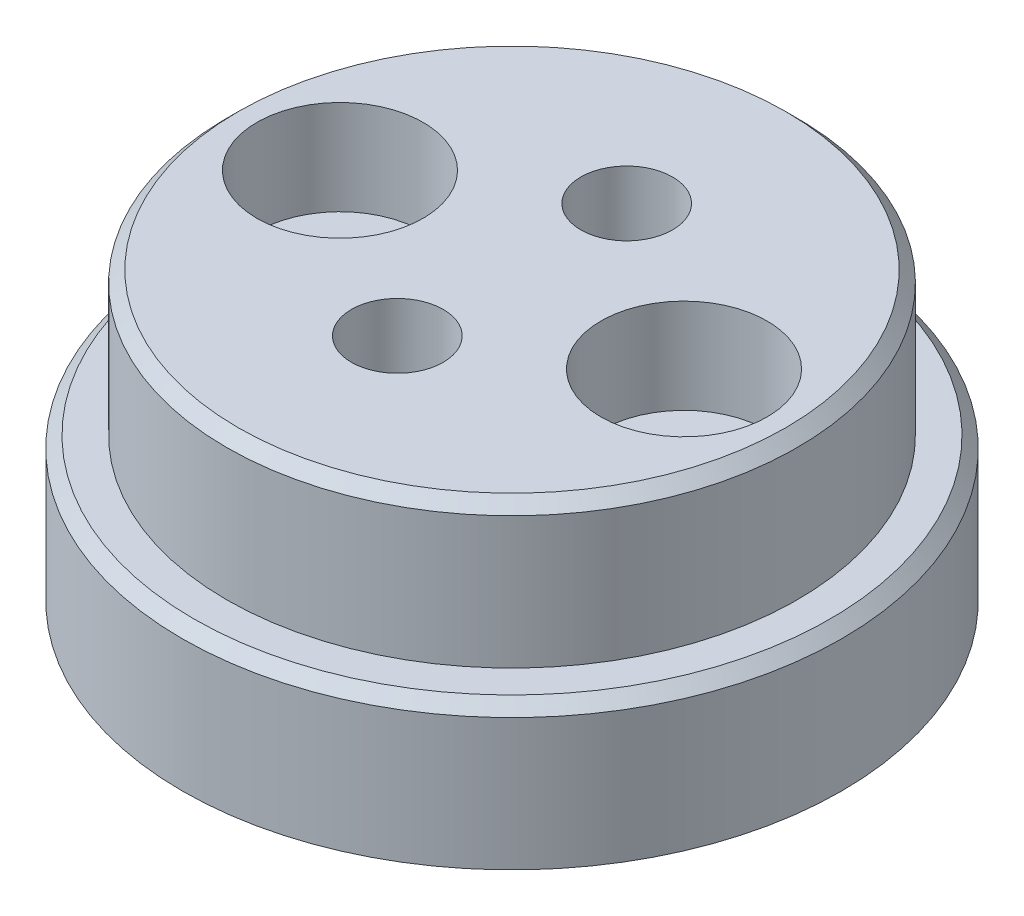
ISO-10303-21;
HEADER;
FILE_DESCRIPTION(('STEP AP214'),'2;1');
FILE_NAME('part.step','',(''),(''),'','','');
FILE_SCHEMA(('AUTOMOTIVE_DESIGN { 1 0 10303 214 1 1 1 1 }'));
ENDSEC;
DATA;
#1=APPLICATION_CONTEXT('core data for automotive mechanical design processes');
#2=APPLICATION_PROTOCOL_DEFINITION('international standard','automotive_design',2000,#1);
#3=PRODUCT_CONTEXT('',#1,'mechanical');
#4=PRODUCT('Part','Part','',(#3));
#5=PRODUCT_RELATED_PRODUCT_CATEGORY('part','',(#4));
#6=PRODUCT_DEFINITION_FORMATION('','',#4);
#7=PRODUCT_DEFINITION_CONTEXT('part definition',#1,'design');
#8=PRODUCT_DEFINITION('design','',#6,#7);
#9=PRODUCT_DEFINITION_SHAPE('','',#8);
#10=(LENGTH_UNIT() NAMED_UNIT(*) SI_UNIT(.MILLI.,.METRE.));
#11=(NAMED_UNIT(*) PLANE_ANGLE_UNIT() SI_UNIT($,.RADIAN.));
#12=(NAMED_UNIT(*) SI_UNIT($,.STERADIAN.) SOLID_ANGLE_UNIT());
#13=UNCERTAINTY_MEASURE_WITH_UNIT(LENGTH_MEASURE(1.E-05),#10,'distance_accuracy_value','');
#14=(GEOMETRIC_REPRESENTATION_CONTEXT(3) GLOBAL_UNCERTAINTY_ASSIGNED_CONTEXT((#13)) GLOBAL_UNIT_ASSIGNED_CONTEXT((#10,
#11,#12)) REPRESENTATION_CONTEXT('',''));
#15=CARTESIAN_POINT('',(0.,0.,0.));
#16=DIRECTION('',(0.,0.,1.));
#17=DIRECTION('',(1.,0.,0.));
#18=AXIS2_PLACEMENT_3D('',#15,#16,#17);
#19=CARTESIAN_POINT('',(6.00000000000017,5.,1.70436581514721E-13));
#20=DIRECTION('',(0.,-1.,0.));
#21=DIRECTION('',(0.,0.,-1.));
#22=AXIS2_PLACEMENT_3D('',#19,#20,#21);
#23=CYLINDRICAL_SURFACE('',#22,1.7);
#24=CARTESIAN_POINT('',(6.00000000000017,0.,1.70436581514721E-13));
#25=DIRECTION('',(0.,1.,0.));
#26=DIRECTION('',(0.,0.,1.));
#27=AXIS2_PLACEMENT_3D('',#24,#25,#26);
#28=CIRCLE('',#27,1.7);
#29=CARTESIAN_POINT('',(6.00000000000017,0.,1.70000000000017));
#30=VERTEX_POINT('',#29);
#31=EDGE_CURVE('E92',#30,#30,#28,.T.);
#32=ORIENTED_EDGE('',*,*,#31,.F.);
#33=EDGE_LOOP('',(#32));
#34=FACE_BOUND('',#33,.T.);
#35=CARTESIAN_POINT('',(6.00000000000017,6.7,1.70436581514721E-13));
#36=DIRECTION('',(0.,1.,0.));
#37=DIRECTION('',(0.,0.,1.));
#38=AXIS2_PLACEMENT_3D('',#35,#36,#37);
#39=CIRCLE('',#38,1.7);
#40=CARTESIAN_POINT('',(6.00000000000017,6.7,1.70000000000017));
#41=VERTEX_POINT('',#40);
#42=EDGE_CURVE('E34',#41,#41,#39,.T.);
#43=ORIENTED_EDGE('',*,*,#42,.T.);
#44=EDGE_LOOP('',(#43));
#45=FACE_BOUND('',#44,.T.);
#46=ADVANCED_FACE('F30',(#34,#45),#23,.F.);
#47=CARTESIAN_POINT('',(-5.99999999999983,5.,1.70436581514721E-13));
#48=DIRECTION('',(0.,-1.,0.));
#49=DIRECTION('',(0.,0.,-1.));
#50=AXIS2_PLACEMENT_3D('',#47,#48,#49);
#51=CYLINDRICAL_SURFACE('',#50,1.7);
#52=CARTESIAN_POINT('',(-5.99999999999983,0.,1.70436581514721E-13));
#53=DIRECTION('',(0.,1.,0.));
#54=DIRECTION('',(0.,0.,1.));
#55=AXIS2_PLACEMENT_3D('',#52,#53,#54);
#56=CIRCLE('',#55,1.7);
#57=CARTESIAN_POINT('',(-5.99999999999983,0.,1.70000000000017));
#58=VERTEX_POINT('',#57);
#59=EDGE_CURVE('E89',#58,#58,#56,.T.);
#60=ORIENTED_EDGE('',*,*,#59,.F.);
#61=EDGE_LOOP('',(#60));
#62=FACE_BOUND('',#61,.T.);
#63=CARTESIAN_POINT('',(-5.99999999999983,6.7,1.70436581514721E-13));
#64=DIRECTION('',(0.,1.,0.));
#65=DIRECTION('',(0.,0.,1.));
#66=AXIS2_PLACEMENT_3D('',#63,#64,#65);
#67=CIRCLE('',#66,1.7);
#68=CARTESIAN_POINT('',(-5.99999999999983,6.7,1.70000000000017));
#69=VERTEX_POINT('',#68);
#70=EDGE_CURVE('E56',#69,#69,#67,.T.);
#71=ORIENTED_EDGE('',*,*,#70,.T.);
#72=EDGE_LOOP('',(#71));
#73=FACE_BOUND('',#72,.T.);
#74=ADVANCED_FACE('F153',(#62,#73),#51,.F.);
#75=CARTESIAN_POINT('',(0.,5.,4.));
#76=DIRECTION('',(0.,-1.,0.));
#77=DIRECTION('',(0.,0.,-1.));
#78=AXIS2_PLACEMENT_3D('',#75,#76,#77);
#79=CYLINDRICAL_SURFACE('',#78,1.6);
#80=CARTESIAN_POINT('',(0.,10.,4.));
#81=DIRECTION('',(0.,1.,0.));
#82=DIRECTION('',(0.,0.,1.));
#83=AXIS2_PLACEMENT_3D('',#80,#81,#82);
#84=CIRCLE('',#83,1.6);
#85=CARTESIAN_POINT('',(0.,10.,5.6));
#86=VERTEX_POINT('',#85);
#87=EDGE_CURVE('E83',#86,#86,#84,.T.);
#88=ORIENTED_EDGE('',*,*,#87,.T.);
#89=EDGE_LOOP('',(#88));
#90=FACE_BOUND('',#89,.T.);
#91=CARTESIAN_POINT('',(0.,5.7,4.));
#92=DIRECTION('',(0.,-1.,0.));
#93=DIRECTION('',(0.,0.,-1.));
#94=AXIS2_PLACEMENT_3D('',#91,#92,#93);
#95=CIRCLE('',#94,1.6);
#96=CARTESIAN_POINT('',(0.,5.7,2.4));
#97=VERTEX_POINT('',#96);
#98=EDGE_CURVE('E52',#97,#97,#95,.T.);
#99=ORIENTED_EDGE('',*,*,#98,.T.);
#100=EDGE_LOOP('',(#99));
#101=FACE_BOUND('',#100,.T.);
#102=ADVANCED_FACE('F125',(#90,#101),#79,.F.);
#103=CARTESIAN_POINT('',(0.,5.,-4.));
#104=DIRECTION('',(0.,-1.,0.));
#105=DIRECTION('',(0.,0.,-1.));
#106=AXIS2_PLACEMENT_3D('',#103,#104,#105);
#107=CYLINDRICAL_SURFACE('',#106,1.6);
#108=CARTESIAN_POINT('',(0.,10.,-4.));
#109=DIRECTION('',(0.,1.,0.));
#110=DIRECTION('',(0.,0.,1.));
#111=AXIS2_PLACEMENT_3D('',#108,#109,#110);
#112=CIRCLE('',#111,1.6);
#113=CARTESIAN_POINT('',(0.,10.,-2.4));
#114=VERTEX_POINT('',#113);
#115=EDGE_CURVE('E50',#114,#114,#112,.T.);
#116=ORIENTED_EDGE('',*,*,#115,.T.);
#117=EDGE_LOOP('',(#116));
#118=FACE_BOUND('',#117,.T.);
#119=CARTESIAN_POINT('',(0.,5.7,-4.));
#120=DIRECTION('',(0.,-1.,0.));
#121=DIRECTION('',(0.,0.,-1.));
#122=AXIS2_PLACEMENT_3D('',#119,#120,#121);
#123=CIRCLE('',#122,1.6);
#124=CARTESIAN_POINT('',(0.,5.7,-5.6));
#125=VERTEX_POINT('',#124);
#126=EDGE_CURVE('E47',#125,#125,#123,.T.);
#127=ORIENTED_EDGE('',*,*,#126,.T.);
#128=EDGE_LOOP('',(#127));
#129=FACE_BOUND('',#128,.T.);
#130=ADVANCED_FACE('F121',(#118,#129),#107,.F.);
#131=CARTESIAN_POINT('',(0.,5.,0.));
#132=DIRECTION('',(0.,1.,0.));
#133=DIRECTION('',(0.,0.,1.));
#134=AXIS2_PLACEMENT_3D('',#131,#132,#133);
#135=PLANE('',#134);
#136=CARTESIAN_POINT('',(0.,5.,0.));
#137=DIRECTION('',(0.,1.,0.));
#138=DIRECTION('',(0.,0.,1.));
#139=AXIS2_PLACEMENT_3D('',#136,#137,#138);
#140=CIRCLE('',#139,11.1);
#141=CARTESIAN_POINT('',(0.,5.,11.1));
#142=VERTEX_POINT('',#141);
#143=EDGE_CURVE('E38',#142,#142,#140,.T.);
#144=ORIENTED_EDGE('',*,*,#143,.T.);
#145=EDGE_LOOP('',(#144));
#146=FACE_BOUND('',#145,.T.);
#147=CARTESIAN_POINT('',(0.,5.,0.));
#148=DIRECTION('',(0.,1.,0.));
#149=DIRECTION('',(0.,0.,1.));
#150=AXIS2_PLACEMENT_3D('',#147,#148,#149);
#151=CIRCLE('',#150,9.95);
#152=CARTESIAN_POINT('',(0.,5.,9.95));
#153=VERTEX_POINT('',#152);
#154=EDGE_CURVE('E86',#153,#153,#151,.T.);
#155=ORIENTED_EDGE('',*,*,#154,.F.);
#156=EDGE_LOOP('',(#155));
#157=FACE_BOUND('',#156,.T.);
#158=ADVANCED_FACE('F124',(#146,#157),#135,.T.);
#159=CARTESIAN_POINT('',(0.,0.,0.));
#160=DIRECTION('',(0.,1.,0.));
#161=DIRECTION('',(0.,0.,1.));
#162=AXIS2_PLACEMENT_3D('',#159,#160,#161);
#163=PLANE('',#162);
#164=CARTESIAN_POINT('',(0.,0.,4.));
#165=DIRECTION('',(0.,-1.,0.));
#166=DIRECTION('',(0.,0.,-1.));
#167=AXIS2_PLACEMENT_3D('',#164,#165,#166);
#168=CIRCLE('',#167,2.2);
#169=CARTESIAN_POINT('',(0.,0.,1.8));
#170=VERTEX_POINT('',#169);
#171=EDGE_CURVE('E58',#170,#170,#168,.T.);
#172=ORIENTED_EDGE('',*,*,#171,.F.);
#173=EDGE_LOOP('',(#172));
#174=FACE_BOUND('',#173,.T.);
#175=CARTESIAN_POINT('',(0.,0.,-4.));
#176=DIRECTION('',(0.,-1.,0.));
#177=DIRECTION('',(0.,0.,-1.));
#178=AXIS2_PLACEMENT_3D('',#175,#176,#177);
#179=CIRCLE('',#178,2.2);
#180=CARTESIAN_POINT('',(0.,0.,-6.2));
#181=VERTEX_POINT('',#180);
#182=EDGE_CURVE('E54',#181,#181,#179,.T.);
#183=ORIENTED_EDGE('',*,*,#182,.F.);
#184=EDGE_LOOP('',(#183));
#185=FACE_BOUND('',#184,.T.);
#186=CARTESIAN_POINT('',(0.,0.,0.));
#187=DIRECTION('',(0.,1.,0.));
#188=DIRECTION('',(0.,0.,1.));
#189=AXIS2_PLACEMENT_3D('',#186,#187,#188);
#190=CIRCLE('',#189,11.5);
#191=CARTESIAN_POINT('',(0.,0.,11.5));
#192=VERTEX_POINT('',#191);
#193=EDGE_CURVE('E95',#192,#192,#190,.T.);
#194=ORIENTED_EDGE('',*,*,#193,.F.);
#195=EDGE_LOOP('',(#194));
#196=FACE_BOUND('',#195,.T.);
#197=ORIENTED_EDGE('',*,*,#31,.T.);
#198=EDGE_LOOP('',(#197));
#199=FACE_BOUND('',#198,.T.);
#200=ORIENTED_EDGE('',*,*,#59,.T.);
#201=EDGE_LOOP('',(#200));
#202=FACE_BOUND('',#201,.T.);
#203=ADVANCED_FACE('F142',(#174,#185,#196,#199,#202),#163,.F.);
#204=CARTESIAN_POINT('',(0.,5.,0.));
#205=DIRECTION('',(0.,-1.,0.));
#206=DIRECTION('',(0.,0.,-1.));
#207=AXIS2_PLACEMENT_3D('',#204,#205,#206);
#208=CYLINDRICAL_SURFACE('',#207,11.5);
#209=CARTESIAN_POINT('',(0.,4.6,0.));
#210=DIRECTION('',(0.,1.,0.));
#211=DIRECTION('',(0.,0.,1.));
#212=AXIS2_PLACEMENT_3D('',#209,#210,#211);
#213=CIRCLE('',#212,11.5);
#214=CARTESIAN_POINT('',(0.,4.6,11.5));
#215=VERTEX_POINT('',#214);
#216=EDGE_CURVE('E10',#215,#215,#213,.F.);
#217=ORIENTED_EDGE('',*,*,#216,.T.);
#218=EDGE_LOOP('',(#217));
#219=FACE_BOUND('',#218,.T.);
#220=ORIENTED_EDGE('',*,*,#193,.T.);
#221=EDGE_LOOP('',(#220));
#222=FACE_BOUND('',#221,.T.);
#223=ADVANCED_FACE('F114',(#219,#222),#208,.T.);
#224=CARTESIAN_POINT('',(0.,10.,0.));
#225=DIRECTION('',(0.,1.,0.));
#226=DIRECTION('',(0.,0.,1.));
#227=AXIS2_PLACEMENT_3D('',#224,#225,#226);
#228=PLANE('',#227);
#229=CARTESIAN_POINT('',(6.00000000000017,10.,1.70436581514721E-13));
#230=DIRECTION('',(0.,1.,0.));
#231=DIRECTION('',(0.,0.,1.));
#232=AXIS2_PLACEMENT_3D('',#229,#230,#231);
#233=CIRCLE('',#232,2.9);
#234=CARTESIAN_POINT('',(6.00000000000017,10.,2.90000000000017));
#235=VERTEX_POINT('',#234);
#236=EDGE_CURVE('E72',#235,#235,#233,.T.);
#237=ORIENTED_EDGE('',*,*,#236,.F.);
#238=EDGE_LOOP('',(#237));
#239=FACE_BOUND('',#238,.T.);
#240=CARTESIAN_POINT('',(-5.99999999999983,10.,1.70436581514721E-13));
#241=DIRECTION('',(0.,1.,0.));
#242=DIRECTION('',(0.,0.,1.));
#243=AXIS2_PLACEMENT_3D('',#240,#241,#242);
#244=CIRCLE('',#243,2.9);
#245=CARTESIAN_POINT('',(-5.99999999999983,10.,2.90000000000017));
#246=VERTEX_POINT('',#245);
#247=EDGE_CURVE('E65',#246,#246,#244,.T.);
#248=ORIENTED_EDGE('',*,*,#247,.F.);
#249=EDGE_LOOP('',(#248));
#250=FACE_BOUND('',#249,.T.);
#251=CARTESIAN_POINT('',(0.,10.,0.));
#252=DIRECTION('',(0.,1.,0.));
#253=DIRECTION('',(0.,0.,1.));
#254=AXIS2_PLACEMENT_3D('',#251,#252,#253);
#255=CIRCLE('',#254,9.55);
#256=CARTESIAN_POINT('',(0.,10.,9.55));
#257=VERTEX_POINT('',#256);
#258=EDGE_CURVE('E98',#257,#257,#255,.T.);
#259=ORIENTED_EDGE('',*,*,#258,.T.);
#260=EDGE_LOOP('',(#259));
#261=FACE_BOUND('',#260,.T.);
#262=ORIENTED_EDGE('',*,*,#87,.F.);
#263=EDGE_LOOP('',(#262));
#264=FACE_BOUND('',#263,.T.);
#265=ORIENTED_EDGE('',*,*,#115,.F.);
#266=EDGE_LOOP('',(#265));
#267=FACE_BOUND('',#266,.T.);
#268=ADVANCED_FACE('F111',(#239,#250,#261,#264,#267),#228,.T.);
#269=CARTESIAN_POINT('',(0.,10.,0.));
#270=DIRECTION('',(0.,-1.,0.));
#271=DIRECTION('',(0.,0.,-1.));
#272=AXIS2_PLACEMENT_3D('',#269,#270,#271);
#273=CYLINDRICAL_SURFACE('',#272,9.95);
#274=CARTESIAN_POINT('',(0.,9.6,0.));
#275=DIRECTION('',(0.,1.,0.));
#276=DIRECTION('',(0.,0.,1.));
#277=AXIS2_PLACEMENT_3D('',#274,#275,#276);
#278=CIRCLE('',#277,9.95);
#279=CARTESIAN_POINT('',(0.,9.6,9.95));
#280=VERTEX_POINT('',#279);
#281=EDGE_CURVE('E43',#280,#280,#278,.F.);
#282=ORIENTED_EDGE('',*,*,#281,.T.);
#283=EDGE_LOOP('',(#282));
#284=FACE_BOUND('',#283,.T.);
#285=ORIENTED_EDGE('',*,*,#154,.T.);
#286=EDGE_LOOP('',(#285));
#287=FACE_BOUND('',#286,.T.);
#288=ADVANCED_FACE('F103',(#284,#287),#273,.T.);
#289=CARTESIAN_POINT('',(0.,10.,0.));
#290=DIRECTION('',(0.,-1.,0.));
#291=DIRECTION('',(0.,0.,-1.));
#292=AXIS2_PLACEMENT_3D('',#289,#290,#291);
#293=CONICAL_SURFACE('',#292,9.55,0.785398163397446);
#294=ORIENTED_EDGE('',*,*,#281,.F.);
#295=EDGE_LOOP('',(#294));
#296=FACE_BOUND('',#295,.T.);
#297=ORIENTED_EDGE('',*,*,#258,.F.);
#298=EDGE_LOOP('',(#297));
#299=FACE_BOUND('',#298,.T.);
#300=ADVANCED_FACE('F106',(#296,#299),#293,.T.);
#301=CARTESIAN_POINT('',(0.,5.,0.));
#302=DIRECTION('',(0.,-1.,0.));
#303=DIRECTION('',(0.,0.,-1.));
#304=AXIS2_PLACEMENT_3D('',#301,#302,#303);
#305=CONICAL_SURFACE('',#304,11.1,0.785398163397453);
#306=ORIENTED_EDGE('',*,*,#216,.F.);
#307=EDGE_LOOP('',(#306));
#308=FACE_BOUND('',#307,.T.);
#309=ORIENTED_EDGE('',*,*,#143,.F.);
#310=EDGE_LOOP('',(#309));
#311=FACE_BOUND('',#310,.T.);
#312=ADVANCED_FACE('F32',(#308,#311),#305,.T.);
#313=CARTESIAN_POINT('',(0.,5.7,-4.));
#314=DIRECTION('',(0.,-1.,0.));
#315=DIRECTION('',(0.,0.,-1.));
#316=AXIS2_PLACEMENT_3D('',#313,#314,#315);
#317=CYLINDRICAL_SURFACE('',#316,2.2);
#318=CARTESIAN_POINT('',(0.,5.7,-4.));
#319=DIRECTION('',(0.,-1.,0.));
#320=DIRECTION('',(0.,0.,-1.));
#321=AXIS2_PLACEMENT_3D('',#318,#319,#320);
#322=CIRCLE('',#321,2.2);
#323=CARTESIAN_POINT('',(0.,5.7,-6.2));
#324=VERTEX_POINT('',#323);
#325=EDGE_CURVE('E51',#324,#324,#322,.T.);
#326=ORIENTED_EDGE('',*,*,#325,.F.);
#327=EDGE_LOOP('',(#326));
#328=FACE_BOUND('',#327,.T.);
#329=ORIENTED_EDGE('',*,*,#182,.T.);
#330=EDGE_LOOP('',(#329));
#331=FACE_BOUND('',#330,.T.);
#332=ADVANCED_FACE('F133',(#328,#331),#317,.F.);
#333=CARTESIAN_POINT('',(0.,5.7,-4.));
#334=DIRECTION('',(0.,-1.,0.));
#335=DIRECTION('',(0.,0.,-1.));
#336=AXIS2_PLACEMENT_3D('',#333,#334,#335);
#337=PLANE('',#336);
#338=ORIENTED_EDGE('',*,*,#126,.F.);
#339=EDGE_LOOP('',(#338));
#340=FACE_BOUND('',#339,.T.);
#341=ORIENTED_EDGE('',*,*,#325,.T.);
#342=EDGE_LOOP('',(#341));
#343=FACE_BOUND('',#342,.T.);
#344=ADVANCED_FACE('F129',(#340,#343),#337,.T.);
#345=CARTESIAN_POINT('',(0.,5.7,4.));
#346=DIRECTION('',(0.,-1.,0.));
#347=DIRECTION('',(0.,0.,-1.));
#348=AXIS2_PLACEMENT_3D('',#345,#346,#347);
#349=CYLINDRICAL_SURFACE('',#348,2.2);
#350=CARTESIAN_POINT('',(0.,5.7,4.));
#351=DIRECTION('',(0.,-1.,0.));
#352=DIRECTION('',(0.,0.,-1.));
#353=AXIS2_PLACEMENT_3D('',#350,#351,#352);
#354=CIRCLE('',#353,2.2);
#355=CARTESIAN_POINT('',(0.,5.7,1.8));
#356=VERTEX_POINT('',#355);
#357=EDGE_CURVE('E55',#356,#356,#354,.T.);
#358=ORIENTED_EDGE('',*,*,#357,.F.);
#359=EDGE_LOOP('',(#358));
#360=FACE_BOUND('',#359,.T.);
#361=ORIENTED_EDGE('',*,*,#171,.T.);
#362=EDGE_LOOP('',(#361));
#363=FACE_BOUND('',#362,.T.);
#364=ADVANCED_FACE('F132',(#360,#363),#349,.F.);
#365=CARTESIAN_POINT('',(0.,5.7,4.));
#366=DIRECTION('',(0.,-1.,0.));
#367=DIRECTION('',(0.,0.,-1.));
#368=AXIS2_PLACEMENT_3D('',#365,#366,#367);
#369=PLANE('',#368);
#370=ORIENTED_EDGE('',*,*,#98,.F.);
#371=EDGE_LOOP('',(#370));
#372=FACE_BOUND('',#371,.T.);
#373=ORIENTED_EDGE('',*,*,#357,.T.);
#374=EDGE_LOOP('',(#373));
#375=FACE_BOUND('',#374,.T.);
#376=ADVANCED_FACE('F211',(#372,#375),#369,.T.);
#377=CARTESIAN_POINT('',(-5.99999999999983,6.7,1.70436581514721E-13));
#378=DIRECTION('',(0.,1.,0.));
#379=DIRECTION('',(0.,0.,1.));
#380=AXIS2_PLACEMENT_3D('',#377,#378,#379);
#381=CYLINDRICAL_SURFACE('',#380,2.9);
#382=CARTESIAN_POINT('',(-5.99999999999983,6.7,1.70436581514721E-13));
#383=DIRECTION('',(0.,1.,0.));
#384=DIRECTION('',(0.,0.,1.));
#385=AXIS2_PLACEMENT_3D('',#382,#383,#384);
#386=CIRCLE('',#385,2.9);
#387=CARTESIAN_POINT('',(-5.99999999999983,6.7,2.90000000000017));
#388=VERTEX_POINT('',#387);
#389=EDGE_CURVE('E59',#388,#388,#386,.T.);
#390=ORIENTED_EDGE('',*,*,#389,.F.);
#391=EDGE_LOOP('',(#390));
#392=FACE_BOUND('',#391,.T.);
#393=ORIENTED_EDGE('',*,*,#247,.T.);
#394=EDGE_LOOP('',(#393));
#395=FACE_BOUND('',#394,.T.);
#396=ADVANCED_FACE('F219',(#392,#395),#381,.F.);
#397=CARTESIAN_POINT('',(-5.99999999999983,6.7,1.70436581514721E-13));
#398=DIRECTION('',(0.,1.,0.));
#399=DIRECTION('',(0.,0.,1.));
#400=AXIS2_PLACEMENT_3D('',#397,#398,#399);
#401=PLANE('',#400);
#402=ORIENTED_EDGE('',*,*,#70,.F.);
#403=EDGE_LOOP('',(#402));
#404=FACE_BOUND('',#403,.T.);
#405=ORIENTED_EDGE('',*,*,#389,.T.);
#406=EDGE_LOOP('',(#405));
#407=FACE_BOUND('',#406,.T.);
#408=ADVANCED_FACE('F227',(#404,#407),#401,.T.);
#409=CARTESIAN_POINT('',(6.00000000000017,6.7,1.70436581514721E-13));
#410=DIRECTION('',(0.,1.,0.));
#411=DIRECTION('',(0.,0.,1.));
#412=AXIS2_PLACEMENT_3D('',#409,#410,#411);
#413=CYLINDRICAL_SURFACE('',#412,2.9);
#414=CARTESIAN_POINT('',(6.00000000000017,6.7,1.70436581514721E-13));
#415=DIRECTION('',(0.,1.,0.));
#416=DIRECTION('',(0.,0.,1.));
#417=AXIS2_PLACEMENT_3D('',#414,#415,#416);
#418=CIRCLE('',#417,2.9);
#419=CARTESIAN_POINT('',(6.00000000000017,6.7,2.90000000000017));
#420=VERTEX_POINT('',#419);
#421=EDGE_CURVE('E326',#420,#420,#418,.T.);
#422=ORIENTED_EDGE('',*,*,#421,.F.);
#423=EDGE_LOOP('',(#422));
#424=FACE_BOUND('',#423,.T.);
#425=ORIENTED_EDGE('',*,*,#236,.T.);
#426=EDGE_LOOP('',(#425));
#427=FACE_BOUND('',#426,.T.);
#428=ADVANCED_FACE('F235',(#424,#427),#413,.F.);
#429=CARTESIAN_POINT('',(6.00000000000017,6.7,1.70436581514721E-13));
#430=DIRECTION('',(0.,1.,0.));
#431=DIRECTION('',(0.,0.,1.));
#432=AXIS2_PLACEMENT_3D('',#429,#430,#431);
#433=PLANE('',#432);
#434=ORIENTED_EDGE('',*,*,#42,.F.);
#435=EDGE_LOOP('',(#434));
#436=FACE_BOUND('',#435,.T.);
#437=ORIENTED_EDGE('',*,*,#421,.T.);
#438=EDGE_LOOP('',(#437));
#439=FACE_BOUND('',#438,.T.);
#440=ADVANCED_FACE('F243',(#436,#439),#433,.T.);
#441=CLOSED_SHELL('',(#46,#74,#102,#130,#158,#203,#223,#268,#288,#300,#312,#332,#344,#364,#376,
#396,#408,#428,#440));
#442=MANIFOLD_SOLID_BREP('B2',#441);
#443=ADVANCED_BREP_SHAPE_REPRESENTATION('',(#18,#442),#14);
#444=SHAPE_DEFINITION_REPRESENTATION(#9,#443);
ENDSEC;
END-ISO-10303-21;
